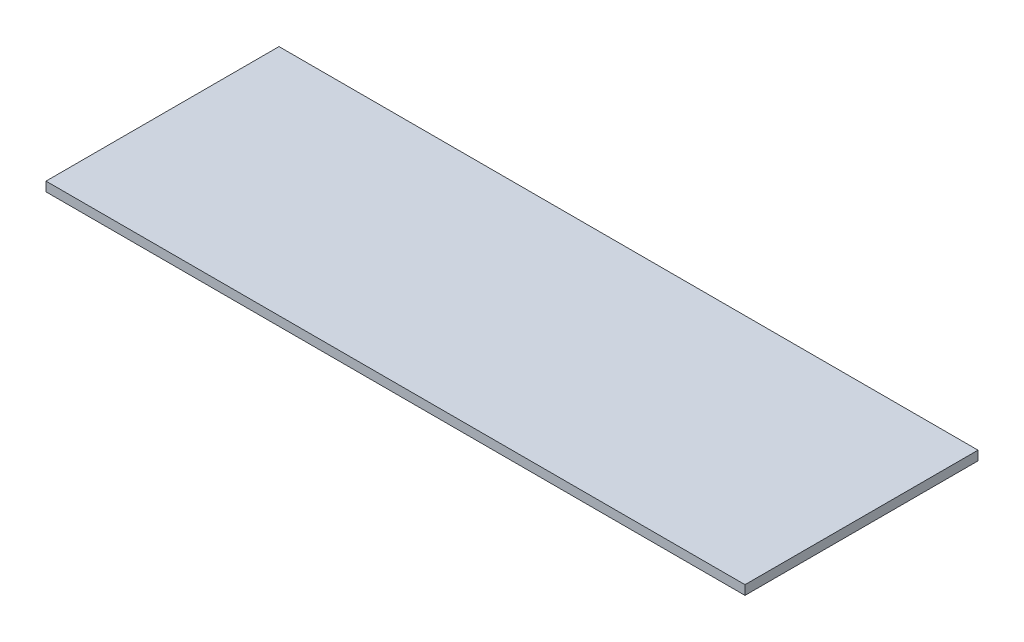
ISO-10303-21;
HEADER;
FILE_DESCRIPTION(('STEP AP214'),'2;1');
FILE_NAME('part.step','',(''),(''),'','','');
FILE_SCHEMA(('AUTOMOTIVE_DESIGN { 1 0 10303 214 1 1 1 1 }'));
ENDSEC;
DATA;
#1=APPLICATION_CONTEXT('core data for automotive mechanical design processes');
#2=APPLICATION_PROTOCOL_DEFINITION('international standard','automotive_design',2000,#1);
#3=PRODUCT_CONTEXT('',#1,'mechanical');
#4=PRODUCT('Part','Part','',(#3));
#5=PRODUCT_RELATED_PRODUCT_CATEGORY('part','',(#4));
#6=PRODUCT_DEFINITION_FORMATION('','',#4);
#7=PRODUCT_DEFINITION_CONTEXT('part definition',#1,'design');
#8=PRODUCT_DEFINITION('design','',#6,#7);
#9=PRODUCT_DEFINITION_SHAPE('','',#8);
#10=(LENGTH_UNIT() NAMED_UNIT(*) SI_UNIT(.MILLI.,.METRE.));
#11=(NAMED_UNIT(*) PLANE_ANGLE_UNIT() SI_UNIT($,.RADIAN.));
#12=(NAMED_UNIT(*) SI_UNIT($,.STERADIAN.) SOLID_ANGLE_UNIT());
#13=UNCERTAINTY_MEASURE_WITH_UNIT(LENGTH_MEASURE(1.E-05),#10,'distance_accuracy_value','');
#14=(GEOMETRIC_REPRESENTATION_CONTEXT(3) GLOBAL_UNCERTAINTY_ASSIGNED_CONTEXT((#13)) GLOBAL_UNIT_ASSIGNED_CONTEXT((#10,
#11,#12)) REPRESENTATION_CONTEXT('',''));
#15=CARTESIAN_POINT('',(0.,0.,0.));
#16=DIRECTION('',(0.,0.,1.));
#17=DIRECTION('',(1.,0.,0.));
#18=AXIS2_PLACEMENT_3D('',#15,#16,#17);
#19=CARTESIAN_POINT('',(0.,1.,0.));
#20=DIRECTION('',(1.,0.,0.));
#21=DIRECTION('',(0.,0.,-1.));
#22=AXIS2_PLACEMENT_3D('',#19,#20,#21);
#23=PLANE('',#22);
#24=DIRECTION('',(0.,0.,1.));
#25=VECTOR('',#24,1.);
#26=CARTESIAN_POINT('',(0.,0.,0.));
#27=LINE('',#26,#25);
#28=CARTESIAN_POINT('',(0.,0.,-25.));
#29=VERTEX_POINT('',#28);
#30=CARTESIAN_POINT('',(0.,0.,0.));
#31=VERTEX_POINT('',#30);
#32=EDGE_CURVE('E97',#29,#31,#27,.T.);
#33=ORIENTED_EDGE('',*,*,#32,.T.);
#34=DIRECTION('',(0.,-1.,0.));
#35=VECTOR('',#34,1.);
#36=CARTESIAN_POINT('',(0.,1.,0.));
#37=LINE('',#36,#35);
#38=CARTESIAN_POINT('',(0.,1.,0.));
#39=VERTEX_POINT('',#38);
#40=EDGE_CURVE('E11',#39,#31,#37,.T.);
#41=ORIENTED_EDGE('',*,*,#40,.F.);
#42=DIRECTION('',(0.,0.,1.));
#43=VECTOR('',#42,1.);
#44=CARTESIAN_POINT('',(0.,1.,0.));
#45=LINE('',#44,#43);
#46=CARTESIAN_POINT('',(0.,1.,-25.));
#47=VERTEX_POINT('',#46);
#48=EDGE_CURVE('E85',#47,#39,#45,.T.);
#49=ORIENTED_EDGE('',*,*,#48,.F.);
#50=DIRECTION('',(0.,-1.,0.));
#51=VECTOR('',#50,1.);
#52=CARTESIAN_POINT('',(0.,1.,-25.));
#53=LINE('',#52,#51);
#54=EDGE_CURVE('E93',#47,#29,#53,.T.);
#55=ORIENTED_EDGE('',*,*,#54,.T.);
#56=EDGE_LOOP('',(#33,#41,#49,#55));
#57=FACE_BOUND('',#56,.T.);
#58=ADVANCED_FACE('F34',(#57),#23,.F.);
#59=CARTESIAN_POINT('',(0.,1.,0.));
#60=DIRECTION('',(0.,0.,-1.));
#61=DIRECTION('',(-1.,0.,0.));
#62=AXIS2_PLACEMENT_3D('',#59,#60,#61);
#63=PLANE('',#62);
#64=DIRECTION('',(1.,0.,0.));
#65=VECTOR('',#64,1.);
#66=CARTESIAN_POINT('',(0.,0.,0.));
#67=LINE('',#66,#65);
#68=CARTESIAN_POINT('',(75.,0.,0.));
#69=VERTEX_POINT('',#68);
#70=EDGE_CURVE('E89',#31,#69,#67,.T.);
#71=ORIENTED_EDGE('',*,*,#70,.T.);
#72=DIRECTION('',(0.,-1.,0.));
#73=VECTOR('',#72,1.);
#74=CARTESIAN_POINT('',(75.,1.,0.));
#75=LINE('',#74,#73);
#76=CARTESIAN_POINT('',(75.,1.,0.));
#77=VERTEX_POINT('',#76);
#78=EDGE_CURVE('E42',#77,#69,#75,.T.);
#79=ORIENTED_EDGE('',*,*,#78,.F.);
#80=DIRECTION('',(1.,0.,0.));
#81=VECTOR('',#80,1.);
#82=CARTESIAN_POINT('',(0.,1.,0.));
#83=LINE('',#82,#81);
#84=EDGE_CURVE('E80',#39,#77,#83,.T.);
#85=ORIENTED_EDGE('',*,*,#84,.F.);
#86=ORIENTED_EDGE('',*,*,#40,.T.);
#87=EDGE_LOOP('',(#71,#79,#85,#86));
#88=FACE_BOUND('',#87,.T.);
#89=ADVANCED_FACE('F88',(#88),#63,.F.);
#90=CARTESIAN_POINT('',(75.,1.,0.));
#91=DIRECTION('',(-1.,0.,0.));
#92=DIRECTION('',(0.,0.,1.));
#93=AXIS2_PLACEMENT_3D('',#90,#91,#92);
#94=PLANE('',#93);
#95=DIRECTION('',(0.,0.,-1.));
#96=VECTOR('',#95,1.);
#97=CARTESIAN_POINT('',(75.,0.,0.));
#98=LINE('',#97,#96);
#99=CARTESIAN_POINT('',(75.,0.,-25.));
#100=VERTEX_POINT('',#99);
#101=EDGE_CURVE('E67',#69,#100,#98,.T.);
#102=ORIENTED_EDGE('',*,*,#101,.T.);
#103=DIRECTION('',(0.,-1.,0.));
#104=VECTOR('',#103,1.);
#105=CARTESIAN_POINT('',(75.,1.,-25.));
#106=LINE('',#105,#104);
#107=CARTESIAN_POINT('',(75.,1.,-25.));
#108=VERTEX_POINT('',#107);
#109=EDGE_CURVE('E90',#108,#100,#106,.T.);
#110=ORIENTED_EDGE('',*,*,#109,.F.);
#111=DIRECTION('',(0.,0.,-1.));
#112=VECTOR('',#111,1.);
#113=CARTESIAN_POINT('',(75.,1.,0.));
#114=LINE('',#113,#112);
#115=EDGE_CURVE('E83',#77,#108,#114,.T.);
#116=ORIENTED_EDGE('',*,*,#115,.F.);
#117=ORIENTED_EDGE('',*,*,#78,.T.);
#118=EDGE_LOOP('',(#102,#110,#116,#117));
#119=FACE_BOUND('',#118,.T.);
#120=ADVANCED_FACE('F91',(#119),#94,.F.);
#121=CARTESIAN_POINT('',(0.,1.,-25.));
#122=DIRECTION('',(0.,0.,1.));
#123=DIRECTION('',(1.,0.,0.));
#124=AXIS2_PLACEMENT_3D('',#121,#122,#123);
#125=PLANE('',#124);
#126=DIRECTION('',(-1.,0.,0.));
#127=VECTOR('',#126,1.);
#128=CARTESIAN_POINT('',(0.,0.,-25.));
#129=LINE('',#128,#127);
#130=EDGE_CURVE('E73',#100,#29,#129,.T.);
#131=ORIENTED_EDGE('',*,*,#130,.T.);
#132=ORIENTED_EDGE('',*,*,#54,.F.);
#133=DIRECTION('',(-1.,0.,0.));
#134=VECTOR('',#133,1.);
#135=CARTESIAN_POINT('',(0.,1.,-25.));
#136=LINE('',#135,#134);
#137=EDGE_CURVE('E50',#108,#47,#136,.T.);
#138=ORIENTED_EDGE('',*,*,#137,.F.);
#139=ORIENTED_EDGE('',*,*,#109,.T.);
#140=EDGE_LOOP('',(#131,#132,#138,#139));
#141=FACE_BOUND('',#140,.T.);
#142=ADVANCED_FACE('F104',(#141),#125,.F.);
#143=CARTESIAN_POINT('',(0.,1.,0.));
#144=DIRECTION('',(0.,-1.,0.));
#145=DIRECTION('',(0.,0.,-1.));
#146=AXIS2_PLACEMENT_3D('',#143,#144,#145);
#147=PLANE('',#146);
#148=ORIENTED_EDGE('',*,*,#48,.T.);
#149=ORIENTED_EDGE('',*,*,#84,.T.);
#150=ORIENTED_EDGE('',*,*,#115,.T.);
#151=ORIENTED_EDGE('',*,*,#137,.T.);
#152=EDGE_LOOP('',(#148,#149,#150,#151));
#153=FACE_BOUND('',#152,.T.);
#154=ADVANCED_FACE('F81',(#153),#147,.F.);
#155=CARTESIAN_POINT('',(0.,0.,0.));
#156=DIRECTION('',(0.,-1.,0.));
#157=DIRECTION('',(0.,0.,-1.));
#158=AXIS2_PLACEMENT_3D('',#155,#156,#157);
#159=PLANE('',#158);
#160=ORIENTED_EDGE('',*,*,#32,.F.);
#161=ORIENTED_EDGE('',*,*,#130,.F.);
#162=ORIENTED_EDGE('',*,*,#101,.F.);
#163=ORIENTED_EDGE('',*,*,#70,.F.);
#164=EDGE_LOOP('',(#160,#161,#162,#163));
#165=FACE_BOUND('',#164,.T.);
#166=ADVANCED_FACE('F107',(#165),#159,.T.);
#167=CLOSED_SHELL('',(#58,#89,#120,#142,#154,#166));
#168=MANIFOLD_SOLID_BREP('B2',#167);
#169=ADVANCED_BREP_SHAPE_REPRESENTATION('',(#18,#168),#14);
#170=SHAPE_DEFINITION_REPRESENTATION(#9,#169);
ENDSEC;
END-ISO-10303-21;
